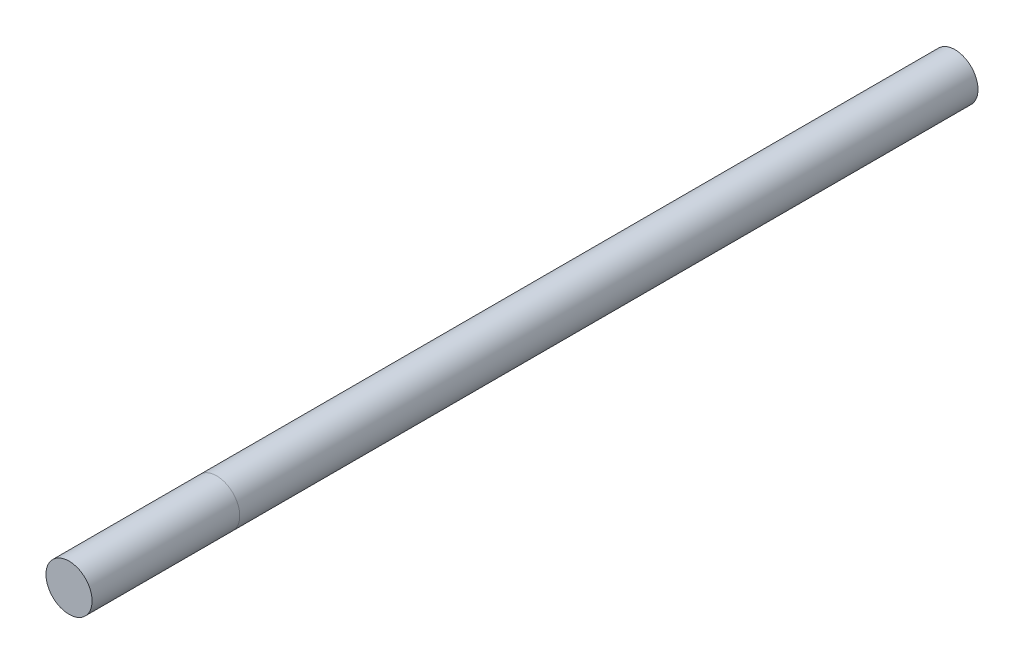
ISO-10303-21;
HEADER;
FILE_DESCRIPTION(('STEP AP214'),'2;1');
FILE_NAME('part.step','',(''),(''),'','','');
FILE_SCHEMA(('AUTOMOTIVE_DESIGN { 1 0 10303 214 1 1 1 1 }'));
ENDSEC;
DATA;
#1=APPLICATION_CONTEXT('core data for automotive mechanical design processes');
#2=APPLICATION_PROTOCOL_DEFINITION('international standard','automotive_design',2000,#1);
#3=PRODUCT_CONTEXT('',#1,'mechanical');
#4=PRODUCT('Part','Part','',(#3));
#5=PRODUCT_RELATED_PRODUCT_CATEGORY('part','',(#4));
#6=PRODUCT_DEFINITION_FORMATION('','',#4);
#7=PRODUCT_DEFINITION_CONTEXT('part definition',#1,'design');
#8=PRODUCT_DEFINITION('design','',#6,#7);
#9=PRODUCT_DEFINITION_SHAPE('','',#8);
#10=(LENGTH_UNIT() NAMED_UNIT(*) SI_UNIT(.MILLI.,.METRE.));
#11=(NAMED_UNIT(*) PLANE_ANGLE_UNIT() SI_UNIT($,.RADIAN.));
#12=(NAMED_UNIT(*) SI_UNIT($,.STERADIAN.) SOLID_ANGLE_UNIT());
#13=UNCERTAINTY_MEASURE_WITH_UNIT(LENGTH_MEASURE(1.E-05),#10,'distance_accuracy_value','');
#14=(GEOMETRIC_REPRESENTATION_CONTEXT(3) GLOBAL_UNCERTAINTY_ASSIGNED_CONTEXT((#13)) GLOBAL_UNIT_ASSIGNED_CONTEXT((#10,
#11,#12)) REPRESENTATION_CONTEXT('',''));
#15=CARTESIAN_POINT('',(0.,0.,0.));
#16=DIRECTION('',(0.,0.,1.));
#17=DIRECTION('',(1.,0.,0.));
#18=AXIS2_PLACEMENT_3D('',#15,#16,#17);
#19=CARTESIAN_POINT('',(0.,0.,96.));
#20=DIRECTION('',(0.,0.,-1.));
#21=DIRECTION('',(-1.,0.,0.));
#22=AXIS2_PLACEMENT_3D('',#19,#20,#21);
#23=CYLINDRICAL_SURFACE('',#22,2.5);
#24=CARTESIAN_POINT('',(0.,0.,96.));
#25=DIRECTION('',(0.,0.,1.));
#26=DIRECTION('',(1.,0.,0.));
#27=AXIS2_PLACEMENT_3D('',#24,#25,#26);
#28=CIRCLE('',#27,2.5);
#29=CARTESIAN_POINT('',(2.5,0.,96.));
#30=VERTEX_POINT('',#29);
#31=EDGE_CURVE('E11',#30,#30,#28,.T.);
#32=ORIENTED_EDGE('',*,*,#31,.F.);
#33=EDGE_LOOP('',(#32));
#34=FACE_BOUND('',#33,.T.);
#35=CARTESIAN_POINT('',(0.,0.,80.));
#36=DIRECTION('',(0.,0.,1.));
#37=DIRECTION('',(1.,0.,0.));
#38=AXIS2_PLACEMENT_3D('',#35,#36,#37);
#39=CIRCLE('',#38,2.5);
#40=CARTESIAN_POINT('',(2.5,0.,80.));
#41=VERTEX_POINT('',#40);
#42=EDGE_CURVE('E45',#41,#41,#39,.T.);
#43=ORIENTED_EDGE('',*,*,#42,.T.);
#44=EDGE_LOOP('',(#43));
#45=FACE_BOUND('',#44,.T.);
#46=ADVANCED_FACE('F42',(#34,#45),#23,.T.);
#47=CARTESIAN_POINT('',(0.,0.,96.));
#48=DIRECTION('',(0.,0.,1.));
#49=DIRECTION('',(1.,0.,0.));
#50=AXIS2_PLACEMENT_3D('',#47,#48,#49);
#51=PLANE('',#50);
#52=ORIENTED_EDGE('',*,*,#31,.T.);
#53=EDGE_LOOP('',(#52));
#54=FACE_BOUND('',#53,.T.);
#55=ADVANCED_FACE('F57',(#54),#51,.T.);
#56=CARTESIAN_POINT('',(0.,0.,80.));
#57=DIRECTION('',(0.,0.,1.));
#58=DIRECTION('',(1.,0.,0.));
#59=AXIS2_PLACEMENT_3D('',#56,#57,#58);
#60=PLANE('',#59);
#61=ORIENTED_EDGE('',*,*,#42,.F.);
#62=EDGE_LOOP('',(#61));
#63=FACE_BOUND('',#62,.T.);
#64=ADVANCED_FACE('F55',(#63),#60,.F.);
#65=CLOSED_SHELL('',(#46,#55,#64));
#66=MANIFOLD_SOLID_BREP('B2',#65);
#67=CARTESIAN_POINT('',(0.,0.,80.));
#68=DIRECTION('',(0.,0.,-1.));
#69=DIRECTION('',(-1.,0.,0.));
#70=AXIS2_PLACEMENT_3D('',#67,#68,#69);
#71=CYLINDRICAL_SURFACE('',#70,2.5);
#72=CARTESIAN_POINT('',(0.,0.,80.));
#73=DIRECTION('',(0.,0.,1.));
#74=DIRECTION('',(1.,0.,0.));
#75=AXIS2_PLACEMENT_3D('',#72,#73,#74);
#76=CIRCLE('',#75,2.5);
#77=CARTESIAN_POINT('',(2.5,0.,80.));
#78=VERTEX_POINT('',#77);
#79=EDGE_CURVE('E41',#78,#78,#76,.T.);
#80=ORIENTED_EDGE('',*,*,#79,.F.);
#81=EDGE_LOOP('',(#80));
#82=FACE_BOUND('',#81,.T.);
#83=CARTESIAN_POINT('',(0.,0.,0.));
#84=DIRECTION('',(0.,0.,1.));
#85=DIRECTION('',(1.,0.,0.));
#86=AXIS2_PLACEMENT_3D('',#83,#84,#85);
#87=CIRCLE('',#86,2.5);
#88=CARTESIAN_POINT('',(2.5,0.,0.));
#89=VERTEX_POINT('',#88);
#90=EDGE_CURVE('E87',#89,#89,#87,.T.);
#91=ORIENTED_EDGE('',*,*,#90,.T.);
#92=EDGE_LOOP('',(#91));
#93=FACE_BOUND('',#92,.T.);
#94=ADVANCED_FACE('F84',(#82,#93),#71,.T.);
#95=CARTESIAN_POINT('',(0.,0.,80.));
#96=DIRECTION('',(0.,0.,1.));
#97=DIRECTION('',(1.,0.,0.));
#98=AXIS2_PLACEMENT_3D('',#95,#96,#97);
#99=PLANE('',#98);
#100=ORIENTED_EDGE('',*,*,#79,.T.);
#101=EDGE_LOOP('',(#100));
#102=FACE_BOUND('',#101,.T.);
#103=ADVANCED_FACE('F99',(#102),#99,.T.);
#104=CARTESIAN_POINT('',(0.,0.,0.));
#105=DIRECTION('',(0.,0.,1.));
#106=DIRECTION('',(1.,0.,0.));
#107=AXIS2_PLACEMENT_3D('',#104,#105,#106);
#108=PLANE('',#107);
#109=ORIENTED_EDGE('',*,*,#90,.F.);
#110=EDGE_LOOP('',(#109));
#111=FACE_BOUND('',#110,.T.);
#112=ADVANCED_FACE('F97',(#111),#108,.F.);
#113=CLOSED_SHELL('',(#94,#103,#112));
#114=MANIFOLD_SOLID_BREP('B6',#113);
#115=ADVANCED_BREP_SHAPE_REPRESENTATION('',(#18,#66,#114),#14);
#116=SHAPE_DEFINITION_REPRESENTATION(#9,#115);
ENDSEC;
END-ISO-10303-21;
